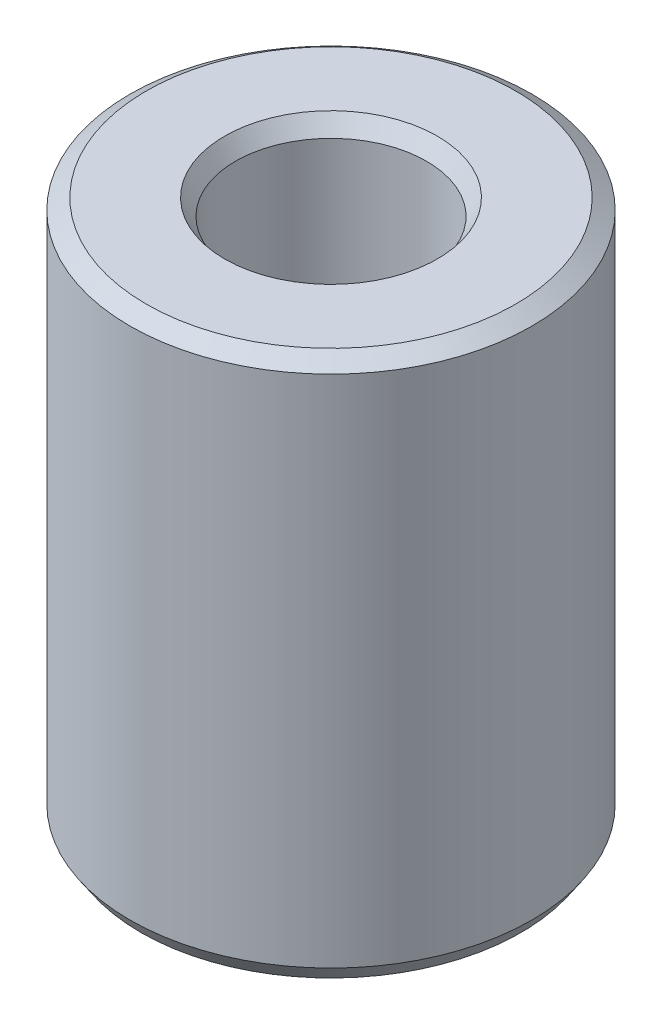
ISO-10303-21;
HEADER;
FILE_DESCRIPTION(('STEP AP214'),'2;1');
FILE_NAME('part.step','',(''),(''),'','','');
FILE_SCHEMA(('AUTOMOTIVE_DESIGN { 1 0 10303 214 1 1 1 1 }'));
ENDSEC;
DATA;
#1=APPLICATION_CONTEXT('core data for automotive mechanical design processes');
#2=APPLICATION_PROTOCOL_DEFINITION('international standard','automotive_design',2000,#1);
#3=PRODUCT_CONTEXT('',#1,'mechanical');
#4=PRODUCT('Part','Part','',(#3));
#5=PRODUCT_RELATED_PRODUCT_CATEGORY('part','',(#4));
#6=PRODUCT_DEFINITION_FORMATION('','',#4);
#7=PRODUCT_DEFINITION_CONTEXT('part definition',#1,'design');
#8=PRODUCT_DEFINITION('design','',#6,#7);
#9=PRODUCT_DEFINITION_SHAPE('','',#8);
#10=(LENGTH_UNIT() NAMED_UNIT(*) SI_UNIT(.MILLI.,.METRE.));
#11=(NAMED_UNIT(*) PLANE_ANGLE_UNIT() SI_UNIT($,.RADIAN.));
#12=(NAMED_UNIT(*) SI_UNIT($,.STERADIAN.) SOLID_ANGLE_UNIT());
#13=UNCERTAINTY_MEASURE_WITH_UNIT(LENGTH_MEASURE(1.E-05),#10,'distance_accuracy_value','');
#14=(GEOMETRIC_REPRESENTATION_CONTEXT(3) GLOBAL_UNCERTAINTY_ASSIGNED_CONTEXT((#13)) GLOBAL_UNIT_ASSIGNED_CONTEXT((#10,
#11,#12)) REPRESENTATION_CONTEXT('',''));
#15=CARTESIAN_POINT('',(0.,0.,0.));
#16=DIRECTION('',(0.,0.,1.));
#17=DIRECTION('',(1.,0.,0.));
#18=AXIS2_PLACEMENT_3D('',#15,#16,#17);
#19=CARTESIAN_POINT('',(0.,26.9455568012335,0.));
#20=DIRECTION('',(0.,-1.,0.));
#21=DIRECTION('',(0.,0.,-1.));
#22=AXIS2_PLACEMENT_3D('',#19,#20,#21);
#23=CYLINDRICAL_SURFACE('',#22,10.);
#24=CARTESIAN_POINT('',(0.,0.809757184888616,0.));
#25=DIRECTION('',(0.,1.,0.));
#26=DIRECTION('',(0.,0.,1.));
#27=AXIS2_PLACEMENT_3D('',#24,#25,#26);
#28=CIRCLE('',#27,10.);
#29=CARTESIAN_POINT('',(0.,0.809757184888616,10.));
#30=VERTEX_POINT('',#29);
#31=EDGE_CURVE('E10',#30,#30,#28,.T.);
#32=ORIENTED_EDGE('',*,*,#31,.T.);
#33=EDGE_LOOP('',(#32));
#34=FACE_BOUND('',#33,.T.);
#35=CARTESIAN_POINT('',(0.,26.4048165110868,0.));
#36=DIRECTION('',(0.,1.,0.));
#37=DIRECTION('',(0.,0.,1.));
#38=AXIS2_PLACEMENT_3D('',#35,#36,#37);
#39=CIRCLE('',#38,10.);
#40=CARTESIAN_POINT('',(0.,26.4048165110868,10.));
#41=VERTEX_POINT('',#40);
#42=EDGE_CURVE('E50',#41,#41,#39,.F.);
#43=ORIENTED_EDGE('',*,*,#42,.T.);
#44=EDGE_LOOP('',(#43));
#45=FACE_BOUND('',#44,.T.);
#46=ADVANCED_FACE('F39',(#34,#45),#23,.T.);
#47=CARTESIAN_POINT('',(0.,26.9455568012335,0.));
#48=DIRECTION('',(0.,1.,0.));
#49=DIRECTION('',(0.,0.,1.));
#50=AXIS2_PLACEMENT_3D('',#47,#48,#49);
#51=PLANE('',#50);
#52=CARTESIAN_POINT('',(0.,26.9455568012335,0.));
#53=DIRECTION('',(0.,1.,0.));
#54=DIRECTION('',(0.,0.,1.));
#55=AXIS2_PLACEMENT_3D('',#52,#53,#54);
#56=CIRCLE('',#55,5.29499700931981);
#57=CARTESIAN_POINT('',(0.,26.9455568012335,5.29499700931981));
#58=VERTEX_POINT('',#57);
#59=EDGE_CURVE('E58',#58,#58,#56,.F.);
#60=ORIENTED_EDGE('',*,*,#59,.T.);
#61=EDGE_LOOP('',(#60));
#62=FACE_BOUND('',#61,.T.);
#63=CARTESIAN_POINT('',(0.,26.9455568012335,0.));
#64=DIRECTION('',(0.,1.,0.));
#65=DIRECTION('',(0.,0.,1.));
#66=AXIS2_PLACEMENT_3D('',#63,#64,#65);
#67=CIRCLE('',#66,9.19024281511139);
#68=CARTESIAN_POINT('',(0.,26.9455568012335,9.19024281511139));
#69=VERTEX_POINT('',#68);
#70=EDGE_CURVE('E61',#69,#69,#67,.T.);
#71=ORIENTED_EDGE('',*,*,#70,.T.);
#72=EDGE_LOOP('',(#71));
#73=FACE_BOUND('',#72,.T.);
#74=ADVANCED_FACE('F88',(#62,#73),#51,.T.);
#75=CARTESIAN_POINT('',(0.,0.,0.));
#76=DIRECTION('',(0.,1.,0.));
#77=DIRECTION('',(0.,0.,1.));
#78=AXIS2_PLACEMENT_3D('',#75,#76,#77);
#79=PLANE('',#78);
#80=CARTESIAN_POINT('',(0.,0.,0.));
#81=DIRECTION('',(0.,1.,0.));
#82=DIRECTION('',(0.,0.,1.));
#83=AXIS2_PLACEMENT_3D('',#80,#81,#82);
#84=CIRCLE('',#83,5.56401390406177);
#85=CARTESIAN_POINT('',(0.,0.,5.56401390406177));
#86=VERTEX_POINT('',#85);
#87=EDGE_CURVE('E51',#86,#86,#84,.T.);
#88=ORIENTED_EDGE('',*,*,#87,.T.);
#89=EDGE_LOOP('',(#88));
#90=FACE_BOUND('',#89,.T.);
#91=CARTESIAN_POINT('',(0.,0.,0.));
#92=DIRECTION('',(0.,1.,0.));
#93=DIRECTION('',(0.,0.,1.));
#94=AXIS2_PLACEMENT_3D('',#91,#92,#93);
#95=CIRCLE('',#94,9.45925970985332);
#96=CARTESIAN_POINT('',(0.,0.,9.45925970985332));
#97=VERTEX_POINT('',#96);
#98=EDGE_CURVE('E54',#97,#97,#95,.F.);
#99=ORIENTED_EDGE('',*,*,#98,.T.);
#100=EDGE_LOOP('',(#99));
#101=FACE_BOUND('',#100,.T.);
#102=ADVANCED_FACE('F83',(#90,#101),#79,.F.);
#103=CARTESIAN_POINT('',(0.,26.9455568012335,0.));
#104=DIRECTION('',(0.,-1.,0.));
#105=DIRECTION('',(0.,0.,-1.));
#106=AXIS2_PLACEMENT_3D('',#103,#104,#105);
#107=CYLINDRICAL_SURFACE('',#106,4.75425671917314);
#108=CARTESIAN_POINT('',(0.,26.1357996163449,0.));
#109=DIRECTION('',(0.,1.,0.));
#110=DIRECTION('',(0.,0.,1.));
#111=AXIS2_PLACEMENT_3D('',#108,#109,#110);
#112=CIRCLE('',#111,4.75425671917314);
#113=CARTESIAN_POINT('',(0.,26.1357996163449,4.75425671917314));
#114=VERTEX_POINT('',#113);
#115=EDGE_CURVE('E67',#114,#114,#112,.T.);
#116=ORIENTED_EDGE('',*,*,#115,.T.);
#117=EDGE_LOOP('',(#116));
#118=FACE_BOUND('',#117,.T.);
#119=CARTESIAN_POINT('',(0.,0.540740290146682,0.));
#120=DIRECTION('',(0.,1.,0.));
#121=DIRECTION('',(0.,0.,1.));
#122=AXIS2_PLACEMENT_3D('',#119,#120,#121);
#123=CIRCLE('',#122,4.75425671917314);
#124=CARTESIAN_POINT('',(0.,0.540740290146682,4.75425671917314));
#125=VERTEX_POINT('',#124);
#126=EDGE_CURVE('E69',#125,#125,#123,.F.);
#127=ORIENTED_EDGE('',*,*,#126,.T.);
#128=EDGE_LOOP('',(#127));
#129=FACE_BOUND('',#128,.T.);
#130=ADVANCED_FACE('F71',(#118,#129),#107,.F.);
#131=CARTESIAN_POINT('',(0.,26.1357996163449,0.));
#132=DIRECTION('',(0.,1.,0.));
#133=DIRECTION('',(0.,0.,1.));
#134=AXIS2_PLACEMENT_3D('',#131,#132,#133);
#135=CONICAL_SURFACE('',#134,4.75425671917314,0.588773521009866);
#136=ORIENTED_EDGE('',*,*,#59,.F.);
#137=EDGE_LOOP('',(#136));
#138=FACE_BOUND('',#137,.T.);
#139=ORIENTED_EDGE('',*,*,#115,.F.);
#140=EDGE_LOOP('',(#139));
#141=FACE_BOUND('',#140,.T.);
#142=ADVANCED_FACE('F77',(#138,#141),#135,.F.);
#143=CARTESIAN_POINT('',(0.,0.,0.));
#144=DIRECTION('',(0.,-1.,0.));
#145=DIRECTION('',(0.,0.,-1.));
#146=AXIS2_PLACEMENT_3D('',#143,#144,#145);
#147=CONICAL_SURFACE('',#146,5.56401390406177,0.982022805785033);
#148=ORIENTED_EDGE('',*,*,#126,.F.);
#149=EDGE_LOOP('',(#148));
#150=FACE_BOUND('',#149,.T.);
#151=ORIENTED_EDGE('',*,*,#87,.F.);
#152=EDGE_LOOP('',(#151));
#153=FACE_BOUND('',#152,.T.);
#154=ADVANCED_FACE('F73',(#150,#153),#147,.F.);
#155=CARTESIAN_POINT('',(0.,0.809757184888616,0.));
#156=DIRECTION('',(0.,1.,0.));
#157=DIRECTION('',(0.,0.,1.));
#158=AXIS2_PLACEMENT_3D('',#155,#156,#157);
#159=CONICAL_SURFACE('',#158,10.,0.588773521009864);
#160=ORIENTED_EDGE('',*,*,#98,.F.);
#161=EDGE_LOOP('',(#160));
#162=FACE_BOUND('',#161,.T.);
#163=ORIENTED_EDGE('',*,*,#31,.F.);
#164=EDGE_LOOP('',(#163));
#165=FACE_BOUND('',#164,.T.);
#166=ADVANCED_FACE('F76',(#162,#165),#159,.T.);
#167=CARTESIAN_POINT('',(0.,26.9455568012335,0.));
#168=DIRECTION('',(0.,-1.,0.));
#169=DIRECTION('',(0.,0.,-1.));
#170=AXIS2_PLACEMENT_3D('',#167,#168,#169);
#171=CONICAL_SURFACE('',#170,9.19024281511139,0.98202280578504);
#172=ORIENTED_EDGE('',*,*,#42,.F.);
#173=EDGE_LOOP('',(#172));
#174=FACE_BOUND('',#173,.T.);
#175=ORIENTED_EDGE('',*,*,#70,.F.);
#176=EDGE_LOOP('',(#175));
#177=FACE_BOUND('',#176,.T.);
#178=ADVANCED_FACE('F45',(#174,#177),#171,.T.);
#179=CLOSED_SHELL('',(#46,#74,#102,#130,#142,#154,#166,#178));
#180=MANIFOLD_SOLID_BREP('B2',#179);
#181=ADVANCED_BREP_SHAPE_REPRESENTATION('',(#18,#180),#14);
#182=SHAPE_DEFINITION_REPRESENTATION(#9,#181);
ENDSEC;
END-ISO-10303-21;
